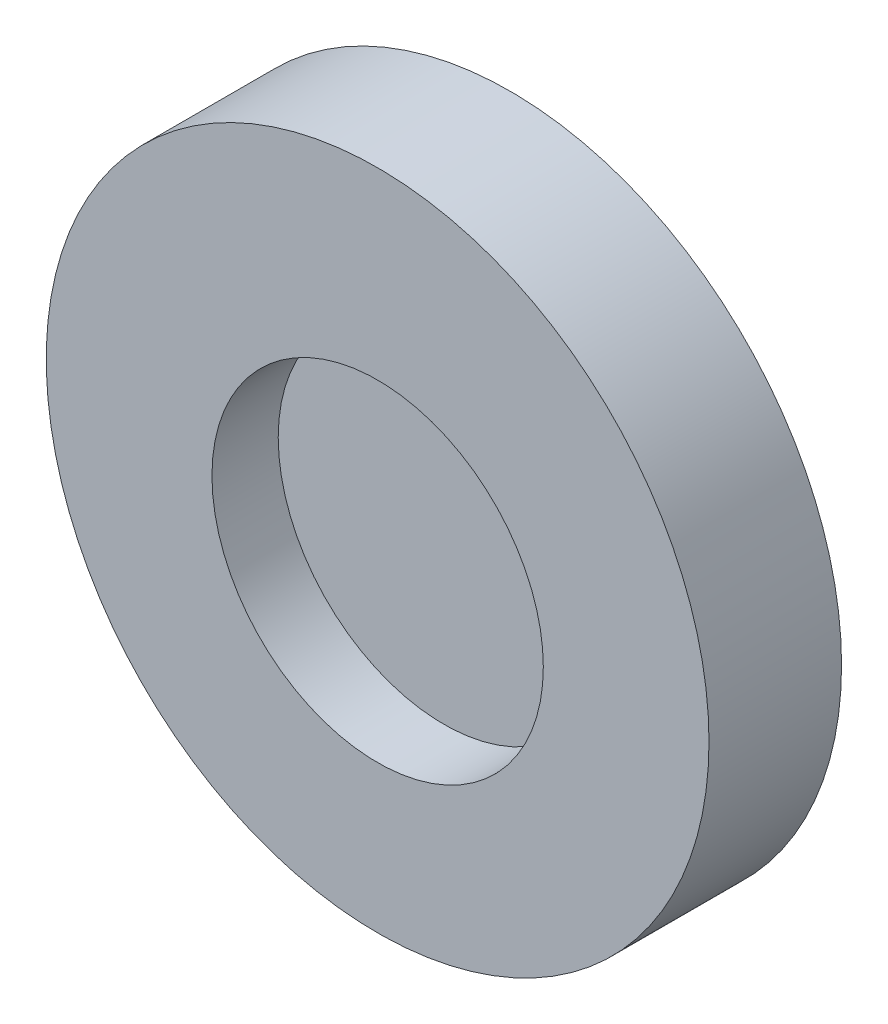
ISO-10303-21;
HEADER;
FILE_DESCRIPTION(('STEP AP214'),'2;1');
FILE_NAME('part.step','',(''),(''),'','','');
FILE_SCHEMA(('AUTOMOTIVE_DESIGN { 1 0 10303 214 1 1 1 1 }'));
ENDSEC;
DATA;
#1=APPLICATION_CONTEXT('core data for automotive mechanical design processes');
#2=APPLICATION_PROTOCOL_DEFINITION('international standard','automotive_design',2000,#1);
#3=PRODUCT_CONTEXT('',#1,'mechanical');
#4=PRODUCT('Part','Part','',(#3));
#5=PRODUCT_RELATED_PRODUCT_CATEGORY('part','',(#4));
#6=PRODUCT_DEFINITION_FORMATION('','',#4);
#7=PRODUCT_DEFINITION_CONTEXT('part definition',#1,'design');
#8=PRODUCT_DEFINITION('design','',#6,#7);
#9=PRODUCT_DEFINITION_SHAPE('','',#8);
#10=(LENGTH_UNIT() NAMED_UNIT(*) SI_UNIT(.MILLI.,.METRE.));
#11=(NAMED_UNIT(*) PLANE_ANGLE_UNIT() SI_UNIT($,.RADIAN.));
#12=(NAMED_UNIT(*) SI_UNIT($,.STERADIAN.) SOLID_ANGLE_UNIT());
#13=UNCERTAINTY_MEASURE_WITH_UNIT(LENGTH_MEASURE(1.E-05),#10,'distance_accuracy_value','');
#14=(GEOMETRIC_REPRESENTATION_CONTEXT(3) GLOBAL_UNCERTAINTY_ASSIGNED_CONTEXT((#13)) GLOBAL_UNIT_ASSIGNED_CONTEXT((#10,
#11,#12)) REPRESENTATION_CONTEXT('',''));
#15=CARTESIAN_POINT('',(0.,0.,0.));
#16=DIRECTION('',(0.,0.,1.));
#17=DIRECTION('',(1.,0.,0.));
#18=AXIS2_PLACEMENT_3D('',#15,#16,#17);
#19=CARTESIAN_POINT('',(0.,0.,25.4));
#20=DIRECTION('',(0.,0.,1.));
#21=DIRECTION('',(1.,0.,0.));
#22=AXIS2_PLACEMENT_3D('',#19,#20,#21);
#23=PLANE('',#22);
#24=CARTESIAN_POINT('',(0.,-6.96805144088829,25.4));
#25=DIRECTION('',(0.,0.,1.));
#26=DIRECTION('',(1.,0.,0.));
#27=AXIS2_PLACEMENT_3D('',#24,#25,#26);
#28=CIRCLE('',#27,63.5);
#29=CARTESIAN_POINT('',(63.5,-6.96805144088829,25.4));
#30=VERTEX_POINT('',#29);
#31=EDGE_CURVE('E17',#30,#30,#28,.T.);
#32=ORIENTED_EDGE('',*,*,#31,.T.);
#33=EDGE_LOOP('',(#32));
#34=FACE_BOUND('',#33,.T.);
#35=ADVANCED_FACE('F14',(#34),#23,.T.);
#36=CARTESIAN_POINT('',(0.,-6.96805144088829,50.8));
#37=DIRECTION('',(0.,0.,1.));
#38=DIRECTION('',(1.,0.,0.));
#39=AXIS2_PLACEMENT_3D('',#36,#37,#38);
#40=CYLINDRICAL_SURFACE('',#39,63.5);
#41=ORIENTED_EDGE('',*,*,#31,.F.);
#42=EDGE_LOOP('',(#41));
#43=FACE_BOUND('',#42,.T.);
#44=CARTESIAN_POINT('',(0.,-6.96805144088829,50.8));
#45=DIRECTION('',(0.,0.,1.));
#46=DIRECTION('',(1.,0.,0.));
#47=AXIS2_PLACEMENT_3D('',#44,#45,#46);
#48=CIRCLE('',#47,63.5);
#49=CARTESIAN_POINT('',(63.5,-6.96805144088829,50.8));
#50=VERTEX_POINT('',#49);
#51=EDGE_CURVE('E26',#50,#50,#48,.F.);
#52=ORIENTED_EDGE('',*,*,#51,.F.);
#53=EDGE_LOOP('',(#52));
#54=FACE_BOUND('',#53,.T.);
#55=ADVANCED_FACE('F35',(#43,#54),#40,.F.);
#56=CARTESIAN_POINT('',(0.,0.,50.8));
#57=DIRECTION('',(0.,0.,1.));
#58=DIRECTION('',(1.,0.,0.));
#59=AXIS2_PLACEMENT_3D('',#56,#57,#58);
#60=PLANE('',#59);
#61=ORIENTED_EDGE('',*,*,#51,.T.);
#62=EDGE_LOOP('',(#61));
#63=FACE_BOUND('',#62,.T.);
#64=CARTESIAN_POINT('',(0.,0.,50.8));
#65=DIRECTION('',(0.,0.,1.));
#66=DIRECTION('',(1.,0.,0.));
#67=AXIS2_PLACEMENT_3D('',#64,#65,#66);
#68=CIRCLE('',#67,127.);
#69=CARTESIAN_POINT('',(127.,0.,50.8));
#70=VERTEX_POINT('',#69);
#71=EDGE_CURVE('E21',#70,#70,#68,.F.);
#72=ORIENTED_EDGE('',*,*,#71,.F.);
#73=EDGE_LOOP('',(#72));
#74=FACE_BOUND('',#73,.T.);
#75=ADVANCED_FACE('F38',(#63,#74),#60,.T.);
#76=CARTESIAN_POINT('',(0.,0.,0.));
#77=DIRECTION('',(0.,0.,1.));
#78=DIRECTION('',(1.,0.,0.));
#79=AXIS2_PLACEMENT_3D('',#76,#77,#78);
#80=CYLINDRICAL_SURFACE('',#79,127.);
#81=ORIENTED_EDGE('',*,*,#71,.T.);
#82=EDGE_LOOP('',(#81));
#83=FACE_BOUND('',#82,.T.);
#84=CARTESIAN_POINT('',(0.,0.,0.));
#85=DIRECTION('',(0.,0.,1.));
#86=DIRECTION('',(1.,0.,0.));
#87=AXIS2_PLACEMENT_3D('',#84,#85,#86);
#88=CIRCLE('',#87,127.);
#89=CARTESIAN_POINT('',(127.,0.,0.));
#90=VERTEX_POINT('',#89);
#91=EDGE_CURVE('E9',#90,#90,#88,.T.);
#92=ORIENTED_EDGE('',*,*,#91,.T.);
#93=EDGE_LOOP('',(#92));
#94=FACE_BOUND('',#93,.T.);
#95=ADVANCED_FACE('F44',(#83,#94),#80,.T.);
#96=CARTESIAN_POINT('',(0.,0.,0.));
#97=DIRECTION('',(0.,0.,1.));
#98=DIRECTION('',(1.,0.,0.));
#99=AXIS2_PLACEMENT_3D('',#96,#97,#98);
#100=PLANE('',#99);
#101=ORIENTED_EDGE('',*,*,#91,.F.);
#102=EDGE_LOOP('',(#101));
#103=FACE_BOUND('',#102,.T.);
#104=ADVANCED_FACE('F46',(#103),#100,.F.);
#105=CLOSED_SHELL('',(#35,#55,#75,#95,#104));
#106=MANIFOLD_SOLID_BREP('B1',#105);
#107=ADVANCED_BREP_SHAPE_REPRESENTATION('',(#18,#106),#14);
#108=SHAPE_DEFINITION_REPRESENTATION(#9,#107);
ENDSEC;
END-ISO-10303-21;
